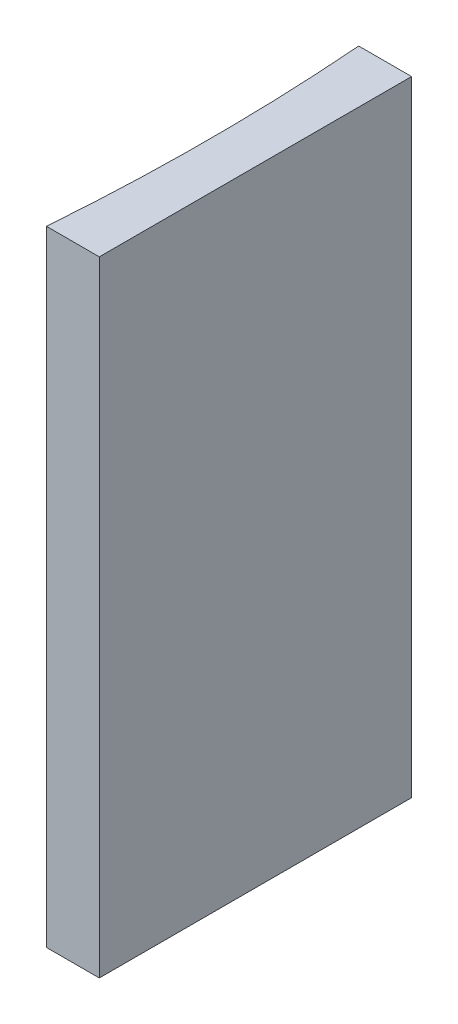
ISO-10303-21;
HEADER;
FILE_DESCRIPTION(('STEP AP214'),'2;1');
FILE_NAME('part.step','',(''),(''),'','','');
FILE_SCHEMA(('AUTOMOTIVE_DESIGN { 1 0 10303 214 1 1 1 1 }'));
ENDSEC;
DATA;
#1=APPLICATION_CONTEXT('core data for automotive mechanical design processes');
#2=APPLICATION_PROTOCOL_DEFINITION('international standard','automotive_design',2000,#1);
#3=PRODUCT_CONTEXT('',#1,'mechanical');
#4=PRODUCT('Part','Part','',(#3));
#5=PRODUCT_RELATED_PRODUCT_CATEGORY('part','',(#4));
#6=PRODUCT_DEFINITION_FORMATION('','',#4);
#7=PRODUCT_DEFINITION_CONTEXT('part definition',#1,'design');
#8=PRODUCT_DEFINITION('design','',#6,#7);
#9=PRODUCT_DEFINITION_SHAPE('','',#8);
#10=(LENGTH_UNIT() NAMED_UNIT(*) SI_UNIT(.MILLI.,.METRE.));
#11=(NAMED_UNIT(*) PLANE_ANGLE_UNIT() SI_UNIT($,.RADIAN.));
#12=(NAMED_UNIT(*) SI_UNIT($,.STERADIAN.) SOLID_ANGLE_UNIT());
#13=UNCERTAINTY_MEASURE_WITH_UNIT(LENGTH_MEASURE(1.E-05),#10,'distance_accuracy_value','');
#14=(GEOMETRIC_REPRESENTATION_CONTEXT(3) GLOBAL_UNCERTAINTY_ASSIGNED_CONTEXT((#13)) GLOBAL_UNIT_ASSIGNED_CONTEXT((#10,
#11,#12)) REPRESENTATION_CONTEXT('',''));
#15=CARTESIAN_POINT('',(0.,0.,0.));
#16=DIRECTION('',(0.,0.,1.));
#17=DIRECTION('',(1.,0.,0.));
#18=AXIS2_PLACEMENT_3D('',#15,#16,#17);
#19=CARTESIAN_POINT('',(0.,40.,0.));
#20=DIRECTION('',(0.,0.,1.));
#21=DIRECTION('',(1.,0.,0.));
#22=AXIS2_PLACEMENT_3D('',#19,#20,#21);
#23=PLANE('',#22);
#24=DIRECTION('',(-1.,0.,0.));
#25=VECTOR('',#24,1.);
#26=CARTESIAN_POINT('',(0.,0.,0.));
#27=LINE('',#26,#25);
#28=CARTESIAN_POINT('',(0.,0.,0.));
#29=VERTEX_POINT('',#28);
#30=CARTESIAN_POINT('',(-3.38742785432225,0.,0.));
#31=VERTEX_POINT('',#30);
#32=EDGE_CURVE('E100',#29,#31,#27,.T.);
#33=ORIENTED_EDGE('',*,*,#32,.T.);
#34=DIRECTION('',(0.,-1.,0.));
#35=VECTOR('',#34,1.);
#36=CARTESIAN_POINT('',(-3.38742785432225,40.,0.));
#37=LINE('',#36,#35);
#38=CARTESIAN_POINT('',(-3.38742785432225,40.,0.));
#39=VERTEX_POINT('',#38);
#40=EDGE_CURVE('E11',#39,#31,#37,.T.);
#41=ORIENTED_EDGE('',*,*,#40,.F.);
#42=DIRECTION('',(-1.,0.,0.));
#43=VECTOR('',#42,1.);
#44=CARTESIAN_POINT('',(0.,40.,0.));
#45=LINE('',#44,#43);
#46=CARTESIAN_POINT('',(0.,40.,0.));
#47=VERTEX_POINT('',#46);
#48=EDGE_CURVE('E88',#47,#39,#45,.T.);
#49=ORIENTED_EDGE('',*,*,#48,.F.);
#50=DIRECTION('',(0.,-1.,0.));
#51=VECTOR('',#50,1.);
#52=CARTESIAN_POINT('',(0.,40.,0.));
#53=LINE('',#52,#51);
#54=EDGE_CURVE('E96',#47,#29,#53,.T.);
#55=ORIENTED_EDGE('',*,*,#54,.T.);
#56=EDGE_LOOP('',(#33,#41,#49,#55));
#57=FACE_BOUND('',#56,.T.);
#58=ADVANCED_FACE('F37',(#57),#23,.F.);
#59=CARTESIAN_POINT('',(-132.25,40.,10.));
#60=DIRECTION('',(0.,-1.,0.));
#61=DIRECTION('',(0.,0.,-1.));
#62=AXIS2_PLACEMENT_3D('',#59,#60,#61);
#63=CYLINDRICAL_SURFACE('',#62,129.25);
#64=CARTESIAN_POINT('',(-132.25,0.,10.));
#65=DIRECTION('',(0.,-1.,0.));
#66=DIRECTION('',(0.,0.,1.));
#67=AXIS2_PLACEMENT_3D('',#64,#65,#66);
#68=CIRCLE('',#67,129.25);
#69=CARTESIAN_POINT('',(-3.38742785432225,0.,20.));
#70=VERTEX_POINT('',#69);
#71=EDGE_CURVE('E92',#31,#70,#68,.T.);
#72=ORIENTED_EDGE('',*,*,#71,.T.);
#73=DIRECTION('',(0.,-1.,0.));
#74=VECTOR('',#73,1.);
#75=CARTESIAN_POINT('',(-3.38742785432225,40.,20.));
#76=LINE('',#75,#74);
#77=CARTESIAN_POINT('',(-3.38742785432225,40.,20.));
#78=VERTEX_POINT('',#77);
#79=EDGE_CURVE('E45',#78,#70,#76,.T.);
#80=ORIENTED_EDGE('',*,*,#79,.F.);
#81=CARTESIAN_POINT('',(-132.25,40.,10.));
#82=DIRECTION('',(0.,-1.,0.));
#83=DIRECTION('',(0.,0.,1.));
#84=AXIS2_PLACEMENT_3D('',#81,#82,#83);
#85=CIRCLE('',#84,129.25);
#86=EDGE_CURVE('E83',#39,#78,#85,.T.);
#87=ORIENTED_EDGE('',*,*,#86,.F.);
#88=ORIENTED_EDGE('',*,*,#40,.T.);
#89=EDGE_LOOP('',(#72,#80,#87,#88));
#90=FACE_BOUND('',#89,.T.);
#91=ADVANCED_FACE('F91',(#90),#63,.F.);
#92=CARTESIAN_POINT('',(0.,40.,20.));
#93=DIRECTION('',(0.,0.,-1.));
#94=DIRECTION('',(-1.,0.,0.));
#95=AXIS2_PLACEMENT_3D('',#92,#93,#94);
#96=PLANE('',#95);
#97=DIRECTION('',(1.,0.,0.));
#98=VECTOR('',#97,1.);
#99=CARTESIAN_POINT('',(0.,0.,20.));
#100=LINE('',#99,#98);
#101=CARTESIAN_POINT('',(0.,0.,20.));
#102=VERTEX_POINT('',#101);
#103=EDGE_CURVE('E70',#70,#102,#100,.T.);
#104=ORIENTED_EDGE('',*,*,#103,.T.);
#105=DIRECTION('',(0.,-1.,0.));
#106=VECTOR('',#105,1.);
#107=CARTESIAN_POINT('',(0.,40.,20.));
#108=LINE('',#107,#106);
#109=CARTESIAN_POINT('',(0.,40.,20.));
#110=VERTEX_POINT('',#109);
#111=EDGE_CURVE('E93',#110,#102,#108,.T.);
#112=ORIENTED_EDGE('',*,*,#111,.F.);
#113=DIRECTION('',(1.,0.,0.));
#114=VECTOR('',#113,1.);
#115=CARTESIAN_POINT('',(0.,40.,20.));
#116=LINE('',#115,#114);
#117=EDGE_CURVE('E86',#78,#110,#116,.T.);
#118=ORIENTED_EDGE('',*,*,#117,.F.);
#119=ORIENTED_EDGE('',*,*,#79,.T.);
#120=EDGE_LOOP('',(#104,#112,#118,#119));
#121=FACE_BOUND('',#120,.T.);
#122=ADVANCED_FACE('F94',(#121),#96,.F.);
#123=CARTESIAN_POINT('',(0.,40.,0.));
#124=DIRECTION('',(-1.,0.,0.));
#125=DIRECTION('',(0.,0.,1.));
#126=AXIS2_PLACEMENT_3D('',#123,#124,#125);
#127=PLANE('',#126);
#128=DIRECTION('',(0.,0.,-1.));
#129=VECTOR('',#128,1.);
#130=CARTESIAN_POINT('',(0.,0.,0.));
#131=LINE('',#130,#129);
#132=EDGE_CURVE('E76',#102,#29,#131,.T.);
#133=ORIENTED_EDGE('',*,*,#132,.T.);
#134=ORIENTED_EDGE('',*,*,#54,.F.);
#135=DIRECTION('',(0.,0.,-1.));
#136=VECTOR('',#135,1.);
#137=CARTESIAN_POINT('',(0.,40.,0.));
#138=LINE('',#137,#136);
#139=EDGE_CURVE('E53',#110,#47,#138,.T.);
#140=ORIENTED_EDGE('',*,*,#139,.F.);
#141=ORIENTED_EDGE('',*,*,#111,.T.);
#142=EDGE_LOOP('',(#133,#134,#140,#141));
#143=FACE_BOUND('',#142,.T.);
#144=ADVANCED_FACE('F107',(#143),#127,.F.);
#145=CARTESIAN_POINT('',(-132.25,40.,10.));
#146=DIRECTION('',(0.,1.,0.));
#147=DIRECTION('',(0.,0.,1.));
#148=AXIS2_PLACEMENT_3D('',#145,#146,#147);
#149=PLANE('',#148);
#150=ORIENTED_EDGE('',*,*,#48,.T.);
#151=ORIENTED_EDGE('',*,*,#86,.T.);
#152=ORIENTED_EDGE('',*,*,#117,.T.);
#153=ORIENTED_EDGE('',*,*,#139,.T.);
#154=EDGE_LOOP('',(#150,#151,#152,#153));
#155=FACE_BOUND('',#154,.T.);
#156=ADVANCED_FACE('F84',(#155),#149,.T.);
#157=CARTESIAN_POINT('',(-132.25,0.,10.));
#158=DIRECTION('',(0.,1.,0.));
#159=DIRECTION('',(0.,0.,1.));
#160=AXIS2_PLACEMENT_3D('',#157,#158,#159);
#161=PLANE('',#160);
#162=ORIENTED_EDGE('',*,*,#32,.F.);
#163=ORIENTED_EDGE('',*,*,#132,.F.);
#164=ORIENTED_EDGE('',*,*,#103,.F.);
#165=ORIENTED_EDGE('',*,*,#71,.F.);
#166=EDGE_LOOP('',(#162,#163,#164,#165));
#167=FACE_BOUND('',#166,.T.);
#168=ADVANCED_FACE('F110',(#167),#161,.F.);
#169=CLOSED_SHELL('',(#58,#91,#122,#144,#156,#168));
#170=MANIFOLD_SOLID_BREP('B2',#169);
#171=ADVANCED_BREP_SHAPE_REPRESENTATION('',(#18,#170),#14);
#172=SHAPE_DEFINITION_REPRESENTATION(#9,#171);
ENDSEC;
END-ISO-10303-21;
